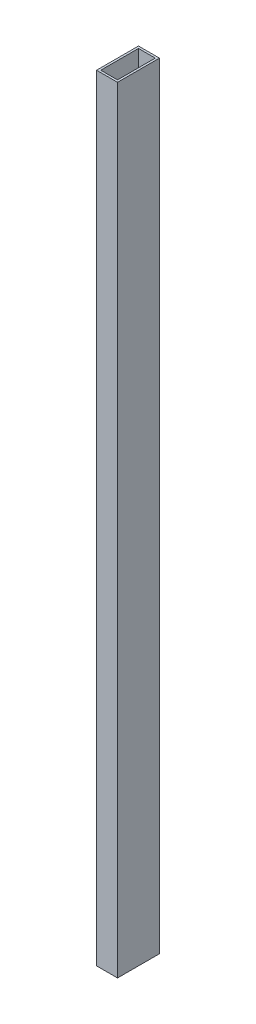
ISO-10303-21;
HEADER;
FILE_DESCRIPTION(('STEP AP214'),'2;1');
FILE_NAME('part.step','',(''),(''),'','','');
FILE_SCHEMA(('AUTOMOTIVE_DESIGN { 1 0 10303 214 1 1 1 1 }'));
ENDSEC;
DATA;
#1=APPLICATION_CONTEXT('core data for automotive mechanical design processes');
#2=APPLICATION_PROTOCOL_DEFINITION('international standard','automotive_design',2000,#1);
#3=PRODUCT_CONTEXT('',#1,'mechanical');
#4=PRODUCT('Part','Part','',(#3));
#5=PRODUCT_RELATED_PRODUCT_CATEGORY('part','',(#4));
#6=PRODUCT_DEFINITION_FORMATION('','',#4);
#7=PRODUCT_DEFINITION_CONTEXT('part definition',#1,'design');
#8=PRODUCT_DEFINITION('design','',#6,#7);
#9=PRODUCT_DEFINITION_SHAPE('','',#8);
#10=(LENGTH_UNIT() NAMED_UNIT(*) SI_UNIT(.MILLI.,.METRE.));
#11=(NAMED_UNIT(*) PLANE_ANGLE_UNIT() SI_UNIT($,.RADIAN.));
#12=(NAMED_UNIT(*) SI_UNIT($,.STERADIAN.) SOLID_ANGLE_UNIT());
#13=UNCERTAINTY_MEASURE_WITH_UNIT(LENGTH_MEASURE(1.E-05),#10,'distance_accuracy_value','');
#14=(GEOMETRIC_REPRESENTATION_CONTEXT(3) GLOBAL_UNCERTAINTY_ASSIGNED_CONTEXT((#13)) GLOBAL_UNIT_ASSIGNED_CONTEXT((#10,
#11,#12)) REPRESENTATION_CONTEXT('',''));
#15=CARTESIAN_POINT('',(0.,0.,0.));
#16=DIRECTION('',(0.,0.,1.));
#17=DIRECTION('',(1.,0.,0.));
#18=AXIS2_PLACEMENT_3D('',#15,#16,#17);
#19=CARTESIAN_POINT('',(0.,740.,0.));
#20=DIRECTION('',(0.,1.,0.));
#21=DIRECTION('',(0.,0.,1.));
#22=AXIS2_PLACEMENT_3D('',#19,#20,#21);
#23=PLANE('',#22);
#24=DIRECTION('',(0.,0.,-1.));
#25=VECTOR('',#24,1.);
#26=CARTESIAN_POINT('',(10.,740.,-20.));
#27=LINE('',#26,#25);
#28=CARTESIAN_POINT('',(10.,740.,20.));
#29=VERTEX_POINT('',#28);
#30=CARTESIAN_POINT('',(10.,740.,-20.));
#31=VERTEX_POINT('',#30);
#32=EDGE_CURVE('E159',#29,#31,#27,.T.);
#33=ORIENTED_EDGE('',*,*,#32,.T.);
#34=DIRECTION('',(-1.,0.,0.));
#35=VECTOR('',#34,1.);
#36=CARTESIAN_POINT('',(-10.,740.,-20.));
#37=LINE('',#36,#35);
#38=CARTESIAN_POINT('',(-10.,740.,-20.));
#39=VERTEX_POINT('',#38);
#40=EDGE_CURVE('E162',#31,#39,#37,.T.);
#41=ORIENTED_EDGE('',*,*,#40,.T.);
#42=DIRECTION('',(0.,0.,1.));
#43=VECTOR('',#42,1.);
#44=CARTESIAN_POINT('',(-10.,740.,-20.));
#45=LINE('',#44,#43);
#46=CARTESIAN_POINT('',(-10.,740.,20.));
#47=VERTEX_POINT('',#46);
#48=EDGE_CURVE('E165',#39,#47,#45,.T.);
#49=ORIENTED_EDGE('',*,*,#48,.T.);
#50=DIRECTION('',(1.,0.,0.));
#51=VECTOR('',#50,1.);
#52=CARTESIAN_POINT('',(-10.,740.,20.));
#53=LINE('',#52,#51);
#54=EDGE_CURVE('E167',#47,#29,#53,.T.);
#55=ORIENTED_EDGE('',*,*,#54,.T.);
#56=EDGE_LOOP('',(#33,#41,#49,#55));
#57=FACE_BOUND('',#56,.T.);
#58=DIRECTION('',(-1.,0.,0.));
#59=VECTOR('',#58,1.);
#60=CARTESIAN_POINT('',(-10.,740.,-18.));
#61=LINE('',#60,#59);
#62=CARTESIAN_POINT('',(8.,740.,-18.));
#63=VERTEX_POINT('',#62);
#64=CARTESIAN_POINT('',(-8.,740.,-18.));
#65=VERTEX_POINT('',#64);
#66=EDGE_CURVE('E131',#63,#65,#61,.T.);
#67=ORIENTED_EDGE('',*,*,#66,.F.);
#68=DIRECTION('',(0.,0.,-1.));
#69=VECTOR('',#68,1.);
#70=CARTESIAN_POINT('',(8.,740.,-20.));
#71=LINE('',#70,#69);
#72=CARTESIAN_POINT('',(8.,740.,18.));
#73=VERTEX_POINT('',#72);
#74=EDGE_CURVE('E123',#73,#63,#71,.T.);
#75=ORIENTED_EDGE('',*,*,#74,.F.);
#76=DIRECTION('',(1.,0.,0.));
#77=VECTOR('',#76,1.);
#78=CARTESIAN_POINT('',(-10.,740.,18.));
#79=LINE('',#78,#77);
#80=CARTESIAN_POINT('',(-8.,740.,18.));
#81=VERTEX_POINT('',#80);
#82=EDGE_CURVE('E145',#81,#73,#79,.T.);
#83=ORIENTED_EDGE('',*,*,#82,.F.);
#84=DIRECTION('',(0.,0.,1.));
#85=VECTOR('',#84,1.);
#86=CARTESIAN_POINT('',(-8.,740.,-20.));
#87=LINE('',#86,#85);
#88=EDGE_CURVE('E143',#65,#81,#87,.T.);
#89=ORIENTED_EDGE('',*,*,#88,.F.);
#90=EDGE_LOOP('',(#67,#75,#83,#89));
#91=FACE_BOUND('',#90,.T.);
#92=ADVANCED_FACE('F58',(#57,#91),#23,.T.);
#93=CARTESIAN_POINT('',(0.,0.,0.));
#94=DIRECTION('',(0.,1.,0.));
#95=DIRECTION('',(0.,0.,1.));
#96=AXIS2_PLACEMENT_3D('',#93,#94,#95);
#97=PLANE('',#96);
#98=DIRECTION('',(0.,0.,-1.));
#99=VECTOR('',#98,1.);
#100=CARTESIAN_POINT('',(10.,0.,-20.));
#101=LINE('',#100,#99);
#102=CARTESIAN_POINT('',(10.,0.,20.));
#103=VERTEX_POINT('',#102);
#104=CARTESIAN_POINT('',(10.,0.,-20.));
#105=VERTEX_POINT('',#104);
#106=EDGE_CURVE('E139',#103,#105,#101,.T.);
#107=ORIENTED_EDGE('',*,*,#106,.F.);
#108=DIRECTION('',(1.,0.,0.));
#109=VECTOR('',#108,1.);
#110=CARTESIAN_POINT('',(-10.,0.,20.));
#111=LINE('',#110,#109);
#112=CARTESIAN_POINT('',(-10.,0.,20.));
#113=VERTEX_POINT('',#112);
#114=EDGE_CURVE('E163',#113,#103,#111,.T.);
#115=ORIENTED_EDGE('',*,*,#114,.F.);
#116=DIRECTION('',(0.,0.,1.));
#117=VECTOR('',#116,1.);
#118=CARTESIAN_POINT('',(-10.,0.,-20.));
#119=LINE('',#118,#117);
#120=CARTESIAN_POINT('',(-10.,0.,-20.));
#121=VERTEX_POINT('',#120);
#122=EDGE_CURVE('E174',#121,#113,#119,.T.);
#123=ORIENTED_EDGE('',*,*,#122,.F.);
#124=DIRECTION('',(-1.,0.,0.));
#125=VECTOR('',#124,1.);
#126=CARTESIAN_POINT('',(-10.,0.,-20.));
#127=LINE('',#126,#125);
#128=EDGE_CURVE('E172',#105,#121,#127,.T.);
#129=ORIENTED_EDGE('',*,*,#128,.F.);
#130=EDGE_LOOP('',(#107,#115,#123,#129));
#131=FACE_BOUND('',#130,.T.);
#132=DIRECTION('',(0.,0.,-1.));
#133=VECTOR('',#132,1.);
#134=CARTESIAN_POINT('',(8.,0.,-20.));
#135=LINE('',#134,#133);
#136=CARTESIAN_POINT('',(8.,0.,18.));
#137=VERTEX_POINT('',#136);
#138=CARTESIAN_POINT('',(8.,0.,-18.));
#139=VERTEX_POINT('',#138);
#140=EDGE_CURVE('E81',#137,#139,#135,.T.);
#141=ORIENTED_EDGE('',*,*,#140,.T.);
#142=DIRECTION('',(-1.,0.,0.));
#143=VECTOR('',#142,1.);
#144=CARTESIAN_POINT('',(-10.,0.,-18.));
#145=LINE('',#144,#143);
#146=CARTESIAN_POINT('',(-8.,0.,-18.));
#147=VERTEX_POINT('',#146);
#148=EDGE_CURVE('E138',#139,#147,#145,.T.);
#149=ORIENTED_EDGE('',*,*,#148,.T.);
#150=DIRECTION('',(0.,0.,1.));
#151=VECTOR('',#150,1.);
#152=CARTESIAN_POINT('',(-8.,0.,-20.));
#153=LINE('',#152,#151);
#154=CARTESIAN_POINT('',(-8.,0.,18.));
#155=VERTEX_POINT('',#154);
#156=EDGE_CURVE('E151',#147,#155,#153,.T.);
#157=ORIENTED_EDGE('',*,*,#156,.T.);
#158=DIRECTION('',(1.,0.,0.));
#159=VECTOR('',#158,1.);
#160=CARTESIAN_POINT('',(-10.,0.,18.));
#161=LINE('',#160,#159);
#162=EDGE_CURVE('E132',#155,#137,#161,.T.);
#163=ORIENTED_EDGE('',*,*,#162,.T.);
#164=EDGE_LOOP('',(#141,#149,#157,#163));
#165=FACE_BOUND('',#164,.T.);
#166=ADVANCED_FACE('F192',(#131,#165),#97,.F.);
#167=CARTESIAN_POINT('',(10.,740.,-20.));
#168=DIRECTION('',(-1.,0.,0.));
#169=DIRECTION('',(0.,0.,1.));
#170=AXIS2_PLACEMENT_3D('',#167,#168,#169);
#171=PLANE('',#170);
#172=ORIENTED_EDGE('',*,*,#106,.T.);
#173=DIRECTION('',(0.,-1.,0.));
#174=VECTOR('',#173,1.);
#175=CARTESIAN_POINT('',(10.,740.,-20.));
#176=LINE('',#175,#174);
#177=EDGE_CURVE('E12',#31,#105,#176,.T.);
#178=ORIENTED_EDGE('',*,*,#177,.F.);
#179=ORIENTED_EDGE('',*,*,#32,.F.);
#180=DIRECTION('',(0.,-1.,0.));
#181=VECTOR('',#180,1.);
#182=CARTESIAN_POINT('',(10.,740.,20.));
#183=LINE('',#182,#181);
#184=EDGE_CURVE('E169',#29,#103,#183,.T.);
#185=ORIENTED_EDGE('',*,*,#184,.T.);
#186=EDGE_LOOP('',(#172,#178,#179,#185));
#187=FACE_BOUND('',#186,.T.);
#188=ADVANCED_FACE('F60',(#187),#171,.F.);
#189=CARTESIAN_POINT('',(-10.,740.,-20.));
#190=DIRECTION('',(0.,0.,1.));
#191=DIRECTION('',(1.,0.,0.));
#192=AXIS2_PLACEMENT_3D('',#189,#190,#191);
#193=PLANE('',#192);
#194=ORIENTED_EDGE('',*,*,#128,.T.);
#195=DIRECTION('',(0.,-1.,0.));
#196=VECTOR('',#195,1.);
#197=CARTESIAN_POINT('',(-10.,740.,-20.));
#198=LINE('',#197,#196);
#199=EDGE_CURVE('E66',#39,#121,#198,.T.);
#200=ORIENTED_EDGE('',*,*,#199,.F.);
#201=ORIENTED_EDGE('',*,*,#40,.F.);
#202=ORIENTED_EDGE('',*,*,#177,.T.);
#203=EDGE_LOOP('',(#194,#200,#201,#202));
#204=FACE_BOUND('',#203,.T.);
#205=ADVANCED_FACE('F202',(#204),#193,.F.);
#206=CARTESIAN_POINT('',(-10.,740.,-20.));
#207=DIRECTION('',(1.,0.,0.));
#208=DIRECTION('',(0.,0.,-1.));
#209=AXIS2_PLACEMENT_3D('',#206,#207,#208);
#210=PLANE('',#209);
#211=ORIENTED_EDGE('',*,*,#122,.T.);
#212=DIRECTION('',(0.,-1.,0.));
#213=VECTOR('',#212,1.);
#214=CARTESIAN_POINT('',(-10.,740.,20.));
#215=LINE('',#214,#213);
#216=EDGE_CURVE('E179',#47,#113,#215,.T.);
#217=ORIENTED_EDGE('',*,*,#216,.F.);
#218=ORIENTED_EDGE('',*,*,#48,.F.);
#219=ORIENTED_EDGE('',*,*,#199,.T.);
#220=EDGE_LOOP('',(#211,#217,#218,#219));
#221=FACE_BOUND('',#220,.T.);
#222=ADVANCED_FACE('F186',(#221),#210,.F.);
#223=CARTESIAN_POINT('',(-10.,740.,20.));
#224=DIRECTION('',(0.,0.,-1.));
#225=DIRECTION('',(-1.,0.,0.));
#226=AXIS2_PLACEMENT_3D('',#223,#224,#225);
#227=PLANE('',#226);
#228=ORIENTED_EDGE('',*,*,#114,.T.);
#229=ORIENTED_EDGE('',*,*,#184,.F.);
#230=ORIENTED_EDGE('',*,*,#54,.F.);
#231=ORIENTED_EDGE('',*,*,#216,.T.);
#232=EDGE_LOOP('',(#228,#229,#230,#231));
#233=FACE_BOUND('',#232,.T.);
#234=ADVANCED_FACE('F196',(#233),#227,.F.);
#235=CARTESIAN_POINT('',(8.,740.,-20.));
#236=DIRECTION('',(-1.,0.,0.));
#237=DIRECTION('',(0.,0.,1.));
#238=AXIS2_PLACEMENT_3D('',#235,#236,#237);
#239=PLANE('',#238);
#240=ORIENTED_EDGE('',*,*,#140,.F.);
#241=DIRECTION('',(0.,-1.,0.));
#242=VECTOR('',#241,1.);
#243=CARTESIAN_POINT('',(8.,740.,18.));
#244=LINE('',#243,#242);
#245=EDGE_CURVE('E127',#73,#137,#244,.T.);
#246=ORIENTED_EDGE('',*,*,#245,.F.);
#247=ORIENTED_EDGE('',*,*,#74,.T.);
#248=DIRECTION('',(0.,-1.,0.));
#249=VECTOR('',#248,1.);
#250=CARTESIAN_POINT('',(8.,740.,-18.));
#251=LINE('',#250,#249);
#252=EDGE_CURVE('E126',#63,#139,#251,.T.);
#253=ORIENTED_EDGE('',*,*,#252,.T.);
#254=EDGE_LOOP('',(#240,#246,#247,#253));
#255=FACE_BOUND('',#254,.T.);
#256=ADVANCED_FACE('F125',(#255),#239,.T.);
#257=CARTESIAN_POINT('',(-10.,740.,-18.));
#258=DIRECTION('',(0.,0.,1.));
#259=DIRECTION('',(1.,0.,0.));
#260=AXIS2_PLACEMENT_3D('',#257,#258,#259);
#261=PLANE('',#260);
#262=ORIENTED_EDGE('',*,*,#148,.F.);
#263=ORIENTED_EDGE('',*,*,#252,.F.);
#264=ORIENTED_EDGE('',*,*,#66,.T.);
#265=DIRECTION('',(0.,-1.,0.));
#266=VECTOR('',#265,1.);
#267=CARTESIAN_POINT('',(-8.,740.,-18.));
#268=LINE('',#267,#266);
#269=EDGE_CURVE('E140',#65,#147,#268,.T.);
#270=ORIENTED_EDGE('',*,*,#269,.T.);
#271=EDGE_LOOP('',(#262,#263,#264,#270));
#272=FACE_BOUND('',#271,.T.);
#273=ADVANCED_FACE('F135',(#272),#261,.T.);
#274=CARTESIAN_POINT('',(-8.,740.,-20.));
#275=DIRECTION('',(1.,0.,0.));
#276=DIRECTION('',(0.,0.,-1.));
#277=AXIS2_PLACEMENT_3D('',#274,#275,#276);
#278=PLANE('',#277);
#279=ORIENTED_EDGE('',*,*,#156,.F.);
#280=ORIENTED_EDGE('',*,*,#269,.F.);
#281=ORIENTED_EDGE('',*,*,#88,.T.);
#282=DIRECTION('',(0.,-1.,0.));
#283=VECTOR('',#282,1.);
#284=CARTESIAN_POINT('',(-8.,740.,18.));
#285=LINE('',#284,#283);
#286=EDGE_CURVE('E73',#81,#155,#285,.T.);
#287=ORIENTED_EDGE('',*,*,#286,.T.);
#288=EDGE_LOOP('',(#279,#280,#281,#287));
#289=FACE_BOUND('',#288,.T.);
#290=ADVANCED_FACE('F225',(#289),#278,.T.);
#291=CARTESIAN_POINT('',(-10.,740.,18.));
#292=DIRECTION('',(0.,0.,-1.));
#293=DIRECTION('',(-1.,0.,0.));
#294=AXIS2_PLACEMENT_3D('',#291,#292,#293);
#295=PLANE('',#294);
#296=ORIENTED_EDGE('',*,*,#162,.F.);
#297=ORIENTED_EDGE('',*,*,#286,.F.);
#298=ORIENTED_EDGE('',*,*,#82,.T.);
#299=ORIENTED_EDGE('',*,*,#245,.T.);
#300=EDGE_LOOP('',(#296,#297,#298,#299));
#301=FACE_BOUND('',#300,.T.);
#302=ADVANCED_FACE('F229',(#301),#295,.T.);
#303=CLOSED_SHELL('',(#92,#166,#188,#205,#222,#234,#256,#273,#290,#302));
#304=MANIFOLD_SOLID_BREP('B2',#303);
#305=ADVANCED_BREP_SHAPE_REPRESENTATION('',(#18,#304),#14);
#306=SHAPE_DEFINITION_REPRESENTATION(#9,#305);
ENDSEC;
END-ISO-10303-21;
